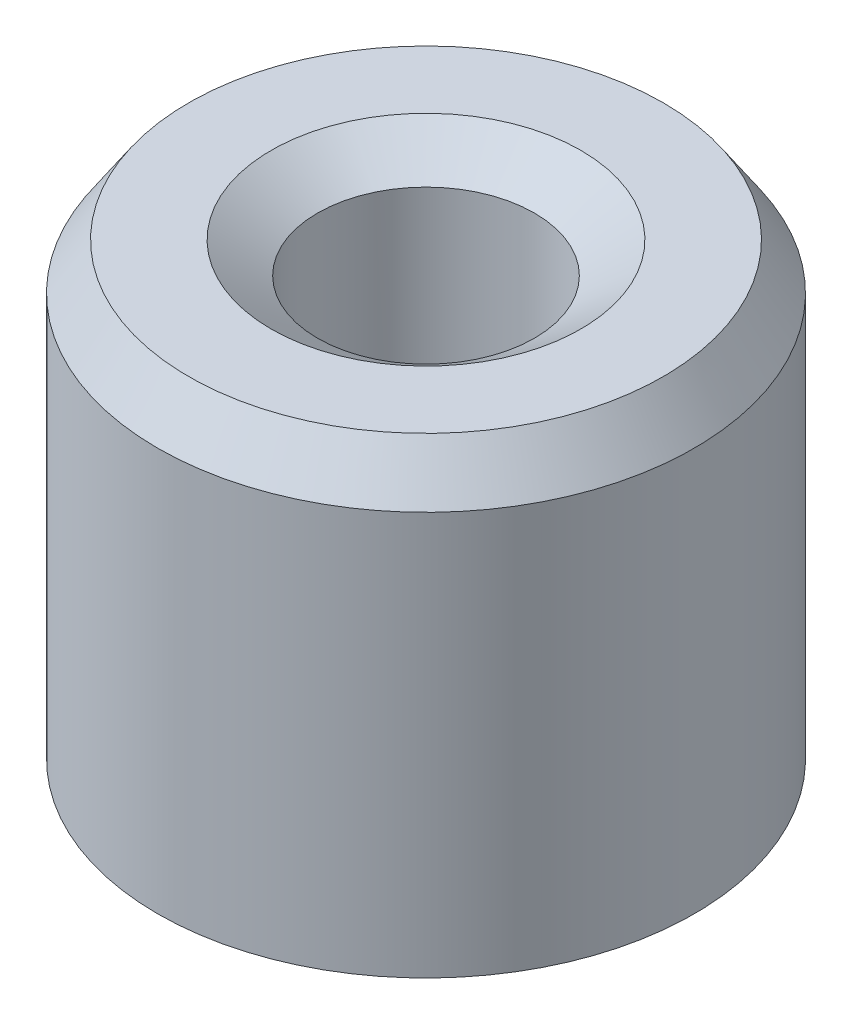
ISO-10303-21;
HEADER;
FILE_DESCRIPTION(('STEP AP214'),'2;1');
FILE_NAME('part.step','',(''),(''),'','','');
FILE_SCHEMA(('AUTOMOTIVE_DESIGN { 1 0 10303 214 1 1 1 1 }'));
ENDSEC;
DATA;
#1=APPLICATION_CONTEXT('core data for automotive mechanical design processes');
#2=APPLICATION_PROTOCOL_DEFINITION('international standard','automotive_design',2000,#1);
#3=PRODUCT_CONTEXT('',#1,'mechanical');
#4=PRODUCT('Part','Part','',(#3));
#5=PRODUCT_RELATED_PRODUCT_CATEGORY('part','',(#4));
#6=PRODUCT_DEFINITION_FORMATION('','',#4);
#7=PRODUCT_DEFINITION_CONTEXT('part definition',#1,'design');
#8=PRODUCT_DEFINITION('design','',#6,#7);
#9=PRODUCT_DEFINITION_SHAPE('','',#8);
#10=(LENGTH_UNIT() NAMED_UNIT(*) SI_UNIT(.MILLI.,.METRE.));
#11=(NAMED_UNIT(*) PLANE_ANGLE_UNIT() SI_UNIT($,.RADIAN.));
#12=(NAMED_UNIT(*) SI_UNIT($,.STERADIAN.) SOLID_ANGLE_UNIT());
#13=UNCERTAINTY_MEASURE_WITH_UNIT(LENGTH_MEASURE(1.E-05),#10,'distance_accuracy_value','');
#14=(GEOMETRIC_REPRESENTATION_CONTEXT(3) GLOBAL_UNCERTAINTY_ASSIGNED_CONTEXT((#13)) GLOBAL_UNIT_ASSIGNED_CONTEXT((#10,
#11,#12)) REPRESENTATION_CONTEXT('',''));
#15=CARTESIAN_POINT('',(0.,0.,0.));
#16=DIRECTION('',(0.,0.,1.));
#17=DIRECTION('',(1.,0.,0.));
#18=AXIS2_PLACEMENT_3D('',#15,#16,#17);
#19=CARTESIAN_POINT('',(0.,8.95790847083966,0.));
#20=DIRECTION('',(0.,-1.,0.));
#21=DIRECTION('',(0.,0.,-1.));
#22=AXIS2_PLACEMENT_3D('',#19,#20,#21);
#23=CYLINDRICAL_SURFACE('',#22,5.);
#24=CARTESIAN_POINT('',(0.,0.580103187830295,0.));
#25=DIRECTION('',(0.,1.,0.));
#26=DIRECTION('',(0.,0.,1.));
#27=AXIS2_PLACEMENT_3D('',#24,#25,#26);
#28=CIRCLE('',#27,5.);
#29=CARTESIAN_POINT('',(0.,0.580103187830295,5.));
#30=VERTEX_POINT('',#29);
#31=EDGE_CURVE('E10',#30,#30,#28,.T.);
#32=ORIENTED_EDGE('',*,*,#31,.T.);
#33=EDGE_LOOP('',(#32));
#34=FACE_BOUND('',#33,.T.);
#35=CARTESIAN_POINT('',(0.,8.09408593940657,0.));
#36=DIRECTION('',(0.,1.,0.));
#37=DIRECTION('',(0.,0.,1.));
#38=AXIS2_PLACEMENT_3D('',#35,#36,#37);
#39=CIRCLE('',#38,5.);
#40=CARTESIAN_POINT('',(0.,8.09408593940657,-5.));
#41=VERTEX_POINT('',#40);
#42=EDGE_CURVE('E50',#41,#41,#39,.F.);
#43=ORIENTED_EDGE('',*,*,#42,.T.);
#44=EDGE_LOOP('',(#43));
#45=FACE_BOUND('',#44,.T.);
#46=ADVANCED_FACE('F39',(#34,#45),#23,.T.);
#47=CARTESIAN_POINT('',(0.,8.95790847083966,0.));
#48=DIRECTION('',(0.,1.,0.));
#49=DIRECTION('',(0.,0.,1.));
#50=AXIS2_PLACEMENT_3D('',#47,#48,#49);
#51=PLANE('',#50);
#52=CARTESIAN_POINT('',(0.,8.95790847083966,0.));
#53=DIRECTION('',(0.,1.,0.));
#54=DIRECTION('',(0.,0.,1.));
#55=AXIS2_PLACEMENT_3D('',#52,#53,#54);
#56=CIRCLE('',#55,2.88440455020472);
#57=CARTESIAN_POINT('',(0.,8.95790847083966,2.88440455020472));
#58=VERTEX_POINT('',#57);
#59=EDGE_CURVE('E58',#58,#58,#56,.F.);
#60=ORIENTED_EDGE('',*,*,#59,.T.);
#61=EDGE_LOOP('',(#60));
#62=FACE_BOUND('',#61,.T.);
#63=CARTESIAN_POINT('',(0.,8.95790847083966,0.));
#64=DIRECTION('',(0.,1.,0.));
#65=DIRECTION('',(0.,0.,1.));
#66=AXIS2_PLACEMENT_3D('',#63,#64,#65);
#67=CIRCLE('',#66,4.41989681216971);
#68=CARTESIAN_POINT('',(0.,8.95790847083966,-4.41989681216971));
#69=VERTEX_POINT('',#68);
#70=EDGE_CURVE('E61',#69,#69,#67,.T.);
#71=ORIENTED_EDGE('',*,*,#70,.T.);
#72=EDGE_LOOP('',(#71));
#73=FACE_BOUND('',#72,.T.);
#74=ADVANCED_FACE('F88',(#62,#73),#51,.T.);
#75=CARTESIAN_POINT('',(0.,0.,0.));
#76=DIRECTION('',(0.,1.,0.));
#77=DIRECTION('',(0.,0.,1.));
#78=AXIS2_PLACEMENT_3D('',#75,#76,#77);
#79=PLANE('',#78);
#80=CARTESIAN_POINT('',(0.,0.,0.));
#81=DIRECTION('',(0.,1.,0.));
#82=DIRECTION('',(0.,0.,1.));
#83=AXIS2_PLACEMENT_3D('',#80,#81,#82);
#84=CIRCLE('',#83,2.60068520660193);
#85=CARTESIAN_POINT('',(0.,0.,-2.60068520660193));
#86=VERTEX_POINT('',#85);
#87=EDGE_CURVE('E51',#86,#86,#84,.T.);
#88=ORIENTED_EDGE('',*,*,#87,.T.);
#89=EDGE_LOOP('',(#88));
#90=FACE_BOUND('',#89,.T.);
#91=CARTESIAN_POINT('',(0.,0.,0.));
#92=DIRECTION('',(0.,1.,0.));
#93=DIRECTION('',(0.,0.,1.));
#94=AXIS2_PLACEMENT_3D('',#91,#92,#93);
#95=CIRCLE('',#94,4.13617746856691);
#96=CARTESIAN_POINT('',(0.,0.,4.13617746856691));
#97=VERTEX_POINT('',#96);
#98=EDGE_CURVE('E54',#97,#97,#95,.F.);
#99=ORIENTED_EDGE('',*,*,#98,.T.);
#100=EDGE_LOOP('',(#99));
#101=FACE_BOUND('',#100,.T.);
#102=ADVANCED_FACE('F83',(#90,#101),#79,.F.);
#103=CARTESIAN_POINT('',(0.,8.95790847083966,0.));
#104=DIRECTION('',(0.,-1.,0.));
#105=DIRECTION('',(0.,0.,-1.));
#106=AXIS2_PLACEMENT_3D('',#103,#104,#105);
#107=CYLINDRICAL_SURFACE('',#106,2.02058201877164);
#108=CARTESIAN_POINT('',(0.,8.37780528300936,0.));
#109=DIRECTION('',(0.,1.,0.));
#110=DIRECTION('',(0.,0.,1.));
#111=AXIS2_PLACEMENT_3D('',#108,#109,#110);
#112=CIRCLE('',#111,2.02058201877164);
#113=CARTESIAN_POINT('',(0.,8.37780528300936,2.02058201877164));
#114=VERTEX_POINT('',#113);
#115=EDGE_CURVE('E67',#114,#114,#112,.T.);
#116=ORIENTED_EDGE('',*,*,#115,.T.);
#117=EDGE_LOOP('',(#116));
#118=FACE_BOUND('',#117,.T.);
#119=CARTESIAN_POINT('',(0.,0.863822531433084,0.));
#120=DIRECTION('',(0.,1.,0.));
#121=DIRECTION('',(0.,0.,1.));
#122=AXIS2_PLACEMENT_3D('',#119,#120,#121);
#123=CIRCLE('',#122,2.02058201877164);
#124=CARTESIAN_POINT('',(0.,0.863822531433083,-2.02058201877164));
#125=VERTEX_POINT('',#124);
#126=EDGE_CURVE('E69',#125,#125,#123,.F.);
#127=ORIENTED_EDGE('',*,*,#126,.T.);
#128=EDGE_LOOP('',(#127));
#129=FACE_BOUND('',#128,.T.);
#130=ADVANCED_FACE('F71',(#118,#129),#107,.F.);
#131=CARTESIAN_POINT('',(0.,8.37780528300936,0.));
#132=DIRECTION('',(0.,1.,0.));
#133=DIRECTION('',(0.,0.,1.));
#134=AXIS2_PLACEMENT_3D('',#131,#132,#133);
#135=CONICAL_SURFACE('',#134,2.02058201877164,0.979418042785444);
#136=ORIENTED_EDGE('',*,*,#59,.F.);
#137=EDGE_LOOP('',(#136));
#138=FACE_BOUND('',#137,.T.);
#139=ORIENTED_EDGE('',*,*,#115,.F.);
#140=EDGE_LOOP('',(#139));
#141=FACE_BOUND('',#140,.T.);
#142=ADVANCED_FACE('F77',(#138,#141),#135,.F.);
#143=CARTESIAN_POINT('',(0.,0.,0.));
#144=DIRECTION('',(0.,-1.,0.));
#145=DIRECTION('',(0.,0.,-1.));
#146=AXIS2_PLACEMENT_3D('',#143,#144,#145);
#147=CONICAL_SURFACE('',#146,2.60068520660193,0.591378284009453);
#148=CARTESIAN_POINT('',(0.,0.863822531433083,-2.02058201877164));
#149=CARTESIAN_POINT('',(0.,0.854824380063989,-2.02662476031154));
#150=CARTESIAN_POINT('',(0.,0.845826228694894,-2.03266750185144));
#151=CARTESIAN_POINT('',(0.,0.827829925956705,-2.04475298493123));
#152=CARTESIAN_POINT('',(0.,0.81883177458761,-2.05079572647113));
#153=CARTESIAN_POINT('',(0.,0.800835471849421,-2.06288120955093));
#154=CARTESIAN_POINT('',(0.,0.791837320480326,-2.06892395109083));
#155=CARTESIAN_POINT('',(0.,0.773841017742137,-2.08100943417063));
#156=CARTESIAN_POINT('',(0.,0.764842866373043,-2.08705217571053));
#157=CARTESIAN_POINT('',(0.,0.746846563634853,-2.09913765879032));
#158=CARTESIAN_POINT('',(0.,0.737848412265759,-2.10518040033022));
#159=CARTESIAN_POINT('',(0.,0.719852109527569,-2.11726588341002));
#160=CARTESIAN_POINT('',(0.,0.710853958158475,-2.12330862494992));
#161=CARTESIAN_POINT('',(0.,0.692857655420286,-2.13539410802972));
#162=CARTESIAN_POINT('',(0.,0.683859504051191,-2.14143684956962));
#163=CARTESIAN_POINT('',(0.,0.665863201313002,-2.15352233264941));
#164=CARTESIAN_POINT('',(0.,0.656865049943907,-2.15956507418931));
#165=CARTESIAN_POINT('',(0.,0.638868747205718,-2.17165055726911));
#166=CARTESIAN_POINT('',(0.,0.629870595836623,-2.17769329880901));
#167=CARTESIAN_POINT('',(0.,0.611874293098434,-2.18977878188881));
#168=CARTESIAN_POINT('',(0.,0.602876141729339,-2.19582152342871));
#169=CARTESIAN_POINT('',(0.,0.58487983899115,-2.2079070065085));
#170=CARTESIAN_POINT('',(0.,0.575881687622056,-2.2139497480484));
#171=CARTESIAN_POINT('',(0.,0.557885384883866,-2.2260352311282));
#172=CARTESIAN_POINT('',(0.,0.548887233514772,-2.2320779726681));
#173=CARTESIAN_POINT('',(0.,0.530890930776582,-2.2441634557479));
#174=CARTESIAN_POINT('',(0.,0.521892779407488,-2.2502061972878));
#175=CARTESIAN_POINT('',(0.,0.503896476669298,-2.26229168036759));
#176=CARTESIAN_POINT('',(0.,0.494898325300204,-2.26833442190749));
#177=CARTESIAN_POINT('',(0.,0.476902022562015,-2.28041990498729));
#178=CARTESIAN_POINT('',(0.,0.46790387119292,-2.28646264652719));
#179=CARTESIAN_POINT('',(0.,0.449907568454731,-2.29854812960699));
#180=CARTESIAN_POINT('',(0.,0.440909417085636,-2.30459087114689));
#181=CARTESIAN_POINT('',(0.,0.422913114347447,-2.31667635422668));
#182=CARTESIAN_POINT('',(0.,0.413914962978352,-2.32271909576658));
#183=CARTESIAN_POINT('',(0.,0.395918660240163,-2.33480457884638));
#184=CARTESIAN_POINT('',(0.,0.386920508871069,-2.34084732038628));
#185=CARTESIAN_POINT('',(0.,0.368924206132879,-2.35293280346608));
#186=CARTESIAN_POINT('',(0.,0.359926054763785,-2.35897554500598));
#187=CARTESIAN_POINT('',(0.,0.341929752025596,-2.37106102808577));
#188=CARTESIAN_POINT('',(0.,0.332931600656501,-2.37710376962567));
#189=CARTESIAN_POINT('',(0.,0.314935297918312,-2.38918925270547));
#190=CARTESIAN_POINT('',(0.,0.305937146549217,-2.39523199424537));
#191=CARTESIAN_POINT('',(0.,0.287940843811028,-2.40731747732517));
#192=CARTESIAN_POINT('',(0.,0.278942692441933,-2.41336021886507));
#193=CARTESIAN_POINT('',(0.,0.260946389703744,-2.42544570194486));
#194=CARTESIAN_POINT('',(0.,0.251948238334649,-2.43148844348476));
#195=CARTESIAN_POINT('',(0.,0.23395193559646,-2.44357392656456));
#196=CARTESIAN_POINT('',(0.,0.224953784227365,-2.44961666810446));
#197=CARTESIAN_POINT('',(0.,0.206957481489176,-2.46170215118426));
#198=CARTESIAN_POINT('',(0.,0.197959330120082,-2.46774489272416));
#199=CARTESIAN_POINT('',(0.,0.179963027381892,-2.47983037580395));
#200=CARTESIAN_POINT('',(0.,0.170964876012798,-2.48587311734385));
#201=CARTESIAN_POINT('',(0.,0.152968573274609,-2.49795860042365));
#202=CARTESIAN_POINT('',(0.,0.143970421905514,-2.50400134196355));
#203=CARTESIAN_POINT('',(0.,0.125974119167325,-2.51608682504335));
#204=CARTESIAN_POINT('',(0.,0.11697596779823,-2.52212956658325));
#205=CARTESIAN_POINT('',(0.,0.0989796650600408,-2.53421504966304));
#206=CARTESIAN_POINT('',(0.,0.0899815136909461,-2.54025779120294));
#207=CARTESIAN_POINT('',(0.,0.0719852109527569,-2.55234327428274));
#208=CARTESIAN_POINT('',(0.,0.0629870595836623,-2.55838601582264));
#209=CARTESIAN_POINT('',(0.,0.0449907568454731,-2.57047149890244));
#210=CARTESIAN_POINT('',(0.,0.0359926054763785,-2.57651424044234));
#211=CARTESIAN_POINT('',(0.,0.0179963027381893,-2.58859972352213));
#212=CARTESIAN_POINT('',(0.,0.00899815136909464,-2.59464246506203));
#213=CARTESIAN_POINT('',(0.,0.,-2.60068520660193));
#214=B_SPLINE_CURVE_WITH_KNOTS('',3,(#148,#149,#150,#151,#152,#153,#154,#155,#156,#157,#158,
#159,#160,#161,#162,#163,#164,#165,#166,#167,#168,#169,#170,#171,#172,#173,#174,#175,#176,#177,
#178,#179,#180,#181,#182,#183,#184,#185,#186,#187,#188,#189,#190,#191,#192,#193,#194,#195,#196,
#197,#198,#199,#200,#201,#202,#203,#204,#205,#206,#207,#208,#209,#210,#211,#212,#213),
.UNSPECIFIED.,.F.,.F.,(4,2,2,2,2,2,2,2,2,2,2,2,2,2,2,2,2,2,2,2,2,2,2,2,2,2,2,2,2,2,2,2,4),(0.,
0.0325166585062554,0.0650333170125107,0.097549975518766,0.130066634025022,0.162583292531277,
0.195099951037532,0.227616609543788,0.260133268050043,0.292649926556299,0.325166585062554,
0.357683243568809,0.390199902075064,0.42271656058132,0.455233219087575,0.487749877593831,
0.520266536100086,0.552783194606342,0.585299853112597,0.617816511618852,0.650333170125108,
0.682849828631363,0.715366487137618,0.747883145643874,0.780399804150129,0.812916462656384,
0.84543312116264,0.877949779668895,0.91046643817515,0.942983096681406,0.975499755187661,
1.00801641369392,1.04053307220017),.UNSPECIFIED.);
#215=EDGE_CURVE('BSEAM73',#125,#86,#214,.T.);
#216=ORIENTED_EDGE('',*,*,#126,.F.);
#217=ORIENTED_EDGE('',*,*,#87,.F.);
#218=ORIENTED_EDGE('',*,*,#215,.T.);
#219=ORIENTED_EDGE('',*,*,#215,.F.);
#220=EDGE_LOOP('',(#216,#218,#217,#219));
#221=FACE_BOUND('',#220,.T.);
#222=ADVANCED_FACE('F73',(#221),#147,.F.);
#223=CARTESIAN_POINT('',(0.,0.580103187830295,0.));
#224=DIRECTION('',(0.,1.,0.));
#225=DIRECTION('',(0.,0.,1.));
#226=AXIS2_PLACEMENT_3D('',#223,#224,#225);
#227=CONICAL_SURFACE('',#226,5.,0.979418042785443);
#228=ORIENTED_EDGE('',*,*,#98,.F.);
#229=EDGE_LOOP('',(#228));
#230=FACE_BOUND('',#229,.T.);
#231=ORIENTED_EDGE('',*,*,#31,.F.);
#232=EDGE_LOOP('',(#231));
#233=FACE_BOUND('',#232,.T.);
#234=ADVANCED_FACE('F76',(#230,#233),#227,.T.);
#235=CARTESIAN_POINT('',(0.,8.95790847083966,0.));
#236=DIRECTION('',(0.,-1.,0.));
#237=DIRECTION('',(0.,0.,-1.));
#238=AXIS2_PLACEMENT_3D('',#235,#236,#237);
#239=CONICAL_SURFACE('',#238,4.41989681216971,0.591378284009454);
#240=CARTESIAN_POINT('',(0.,8.09408593940657,-5.));
#241=CARTESIAN_POINT('',(0.,8.10308409077567,-4.9939572584601));
#242=CARTESIAN_POINT('',(0.,8.11208224214476,-4.9879145169202));
#243=CARTESIAN_POINT('',(0.,8.13007854488295,-4.97582903384041));
#244=CARTESIAN_POINT('',(0.,8.13907669625205,-4.96978629230051));
#245=CARTESIAN_POINT('',(0.,8.15707299899024,-4.95770080922071));
#246=CARTESIAN_POINT('',(0.,8.16607115035933,-4.95165806768081));
#247=CARTESIAN_POINT('',(0.,8.18406745309752,-4.93957258460101));
#248=CARTESIAN_POINT('',(0.,8.19306560446661,-4.93352984306111));
#249=CARTESIAN_POINT('',(0.,8.2110619072048,-4.92144435998132));
#250=CARTESIAN_POINT('',(0.,8.2200600585739,-4.91540161844142));
#251=CARTESIAN_POINT('',(0.,8.23805636131209,-4.90331613536162));
#252=CARTESIAN_POINT('',(0.,8.24705451268118,-4.89727339382172));
#253=CARTESIAN_POINT('',(0.,8.26505081541937,-4.88518791074192));
#254=CARTESIAN_POINT('',(0.,8.27404896678847,-4.87914516920202));
#255=CARTESIAN_POINT('',(0.,8.29204526952665,-4.86705968612223));
#256=CARTESIAN_POINT('',(0.,8.30104342089575,-4.86101694458233));
#257=CARTESIAN_POINT('',(0.,8.31903972363394,-4.84893146150253));
#258=CARTESIAN_POINT('',(0.,8.32803787500303,-4.84288871996263));
#259=CARTESIAN_POINT('',(0.,8.34603417774122,-4.83080323688283));
#260=CARTESIAN_POINT('',(0.,8.35503232911032,-4.82476049534293));
#261=CARTESIAN_POINT('',(0.,8.37302863184851,-4.81267501226313));
#262=CARTESIAN_POINT('',(0.,8.3820267832176,-4.80663227072324));
#263=CARTESIAN_POINT('',(0.,8.40002308595579,-4.79454678764344));
#264=CARTESIAN_POINT('',(0.,8.40902123732489,-4.78850404610354));
#265=CARTESIAN_POINT('',(0.,8.42701754006307,-4.77641856302374));
#266=CARTESIAN_POINT('',(0.,8.43601569143217,-4.77037582148384));
#267=CARTESIAN_POINT('',(0.,8.45401199417036,-4.75829033840404));
#268=CARTESIAN_POINT('',(0.,8.46301014553945,-4.75224759686415));
#269=CARTESIAN_POINT('',(0.,8.48100644827764,-4.74016211378435));
#270=CARTESIAN_POINT('',(0.,8.49000459964674,-4.73411937224445));
#271=CARTESIAN_POINT('',(0.,8.50800090238493,-4.72203388916465));
#272=CARTESIAN_POINT('',(0.,8.51699905375402,-4.71599114762475));
#273=CARTESIAN_POINT('',(0.,8.53499535649221,-4.70390566454495));
#274=CARTESIAN_POINT('',(0.,8.54399350786131,-4.69786292300506));
#275=CARTESIAN_POINT('',(0.,8.56198981059949,-4.68577743992526));
#276=CARTESIAN_POINT('',(0.,8.57098796196859,-4.67973469838536));
#277=CARTESIAN_POINT('',(0.,8.58898426470678,-4.66764921530556));
#278=CARTESIAN_POINT('',(0.,8.59798241607587,-4.66160647376566));
#279=CARTESIAN_POINT('',(0.,8.61597871881406,-4.64952099068586));
#280=CARTESIAN_POINT('',(0.,8.62497687018316,-4.64347824914597));
#281=CARTESIAN_POINT('',(0.,8.64297317292134,-4.63139276606617));
#282=CARTESIAN_POINT('',(0.,8.65197132429044,-4.62535002452627));
#283=CARTESIAN_POINT('',(0.,8.66996762702863,-4.61326454144647));
#284=CARTESIAN_POINT('',(0.,8.67896577839772,-4.60722179990657));
#285=CARTESIAN_POINT('',(0.,8.69696208113591,-4.59513631682678));
#286=CARTESIAN_POINT('',(0.,8.70596023250501,-4.58909357528688));
#287=CARTESIAN_POINT('',(0.,8.7239565352432,-4.57700809220708));
#288=CARTESIAN_POINT('',(0.,8.73295468661229,-4.57096535066718));
#289=CARTESIAN_POINT('',(0.,8.75095098935048,-4.55887986758738));
#290=CARTESIAN_POINT('',(0.,8.75994914071958,-4.55283712604748));
#291=CARTESIAN_POINT('',(0.,8.77794544345776,-4.54075164296768));
#292=CARTESIAN_POINT('',(0.,8.78694359482686,-4.53470890142779));
#293=CARTESIAN_POINT('',(0.,8.80493989756505,-4.52262341834799));
#294=CARTESIAN_POINT('',(0.,8.81393804893414,-4.51658067680809));
#295=CARTESIAN_POINT('',(0.,8.83193435167233,-4.50449519372829));
#296=CARTESIAN_POINT('',(0.,8.84093250304143,-4.49845245218839));
#297=CARTESIAN_POINT('',(0.,8.85892880577962,-4.48636696910859));
#298=CARTESIAN_POINT('',(0.,8.86792695714871,-4.48032422756869));
#299=CARTESIAN_POINT('',(0.,8.8859232598869,-4.4682387444889));
#300=CARTESIAN_POINT('',(0.,8.89492141125599,-4.462196002949));
#301=CARTESIAN_POINT('',(0.,8.91291771399418,-4.4501105198692));
#302=CARTESIAN_POINT('',(0.,8.92191586536328,-4.4440677783293));
#303=CARTESIAN_POINT('',(0.,8.93991216810147,-4.4319822952495));
#304=CARTESIAN_POINT('',(0.,8.94891031947056,-4.4259395537096));
#305=CARTESIAN_POINT('',(0.,8.95790847083966,-4.41989681216971));
#306=B_SPLINE_CURVE_WITH_KNOTS('',3,(#240,#241,#242,#243,#244,#245,#246,#247,#248,#249,#250,
#251,#252,#253,#254,#255,#256,#257,#258,#259,#260,#261,#262,#263,#264,#265,#266,#267,#268,#269,
#270,#271,#272,#273,#274,#275,#276,#277,#278,#279,#280,#281,#282,#283,#284,#285,#286,#287,#288,
#289,#290,#291,#292,#293,#294,#295,#296,#297,#298,#299,#300,#301,#302,#303,#304,#305),
.UNSPECIFIED.,.F.,.F.,(4,2,2,2,2,2,2,2,2,2,2,2,2,2,2,2,2,2,2,2,2,2,2,2,2,2,2,2,2,2,2,2,4),(0.,
0.0325166585062569,0.0650333170125119,0.0975499755187673,0.130066634025022,0.162583292531278,
0.195099951037533,0.227616609543788,0.260133268050044,0.292649926556299,0.325166585062554,
0.357683243568811,0.390199902075066,0.422716560581321,0.455233219087577,0.487749877593832,
0.520266536100087,0.552783194606342,0.585299853112598,0.617816511618853,0.650333170125108,
0.682849828631364,0.71536648713762,0.747883145643875,0.780399804150131,0.812916462656386,
0.845433121162641,0.877949779668896,0.910466438175152,0.942983096681407,0.975499755187662,
1.00801641369392,1.04053307220017),.UNSPECIFIED.);
#307=EDGE_CURVE('BSEAM45',#41,#69,#306,.T.);
#308=ORIENTED_EDGE('',*,*,#42,.F.);
#309=ORIENTED_EDGE('',*,*,#70,.F.);
#310=ORIENTED_EDGE('',*,*,#307,.T.);
#311=ORIENTED_EDGE('',*,*,#307,.F.);
#312=EDGE_LOOP('',(#308,#310,#309,#311));
#313=FACE_BOUND('',#312,.T.);
#314=ADVANCED_FACE('F45',(#313),#239,.T.);
#315=CLOSED_SHELL('',(#46,#74,#102,#130,#142,#222,#234,#314));
#316=MANIFOLD_SOLID_BREP('B2',#315);
#317=ADVANCED_BREP_SHAPE_REPRESENTATION('',(#18,#316),#14);
#318=SHAPE_DEFINITION_REPRESENTATION(#9,#317);
ENDSEC;
END-ISO-10303-21;
